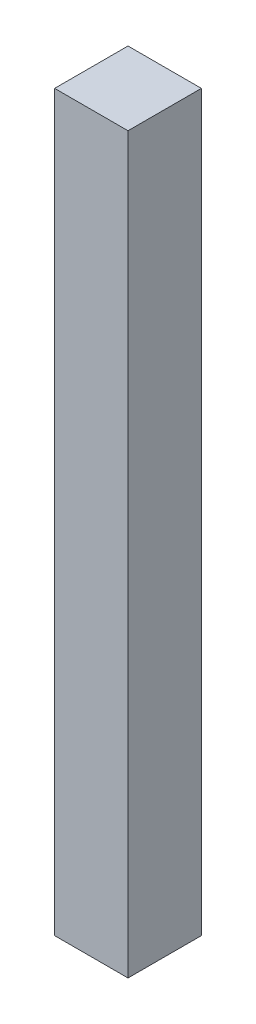
ISO-10303-21;
HEADER;
FILE_DESCRIPTION(('STEP AP214'),'2;1');
FILE_NAME('part.step','',(''),(''),'','','');
FILE_SCHEMA(('AUTOMOTIVE_DESIGN { 1 0 10303 214 1 1 1 1 }'));
ENDSEC;
DATA;
#1=APPLICATION_CONTEXT('core data for automotive mechanical design processes');
#2=APPLICATION_PROTOCOL_DEFINITION('international standard','automotive_design',2000,#1);
#3=PRODUCT_CONTEXT('',#1,'mechanical');
#4=PRODUCT('Part','Part','',(#3));
#5=PRODUCT_RELATED_PRODUCT_CATEGORY('part','',(#4));
#6=PRODUCT_DEFINITION_FORMATION('','',#4);
#7=PRODUCT_DEFINITION_CONTEXT('part definition',#1,'design');
#8=PRODUCT_DEFINITION('design','',#6,#7);
#9=PRODUCT_DEFINITION_SHAPE('','',#8);
#10=(LENGTH_UNIT() NAMED_UNIT(*) SI_UNIT(.MILLI.,.METRE.));
#11=(NAMED_UNIT(*) PLANE_ANGLE_UNIT() SI_UNIT($,.RADIAN.));
#12=(NAMED_UNIT(*) SI_UNIT($,.STERADIAN.) SOLID_ANGLE_UNIT());
#13=UNCERTAINTY_MEASURE_WITH_UNIT(LENGTH_MEASURE(1.E-05),#10,'distance_accuracy_value','');
#14=(GEOMETRIC_REPRESENTATION_CONTEXT(3) GLOBAL_UNCERTAINTY_ASSIGNED_CONTEXT((#13)) GLOBAL_UNIT_ASSIGNED_CONTEXT((#10,
#11,#12)) REPRESENTATION_CONTEXT('',''));
#15=CARTESIAN_POINT('',(0.,0.,0.));
#16=DIRECTION('',(0.,0.,1.));
#17=DIRECTION('',(1.,0.,0.));
#18=AXIS2_PLACEMENT_3D('',#15,#16,#17);
#19=CARTESIAN_POINT('',(5.,-50.,10.));
#20=DIRECTION('',(-1.,0.,0.));
#21=DIRECTION('',(0.,0.,1.));
#22=AXIS2_PLACEMENT_3D('',#19,#20,#21);
#23=PLANE('',#22);
#24=DIRECTION('',(0.,1.,0.));
#25=VECTOR('',#24,1.);
#26=CARTESIAN_POINT('',(5.,-50.,0.));
#27=LINE('',#26,#25);
#28=CARTESIAN_POINT('',(5.,-50.,0.));
#29=VERTEX_POINT('',#28);
#30=CARTESIAN_POINT('',(5.,50.,0.));
#31=VERTEX_POINT('',#30);
#32=EDGE_CURVE('E107',#29,#31,#27,.T.);
#33=ORIENTED_EDGE('',*,*,#32,.T.);
#34=DIRECTION('',(0.,0.,-1.));
#35=VECTOR('',#34,1.);
#36=CARTESIAN_POINT('',(5.,50.,10.));
#37=LINE('',#36,#35);
#38=CARTESIAN_POINT('',(5.,50.,10.));
#39=VERTEX_POINT('',#38);
#40=EDGE_CURVE('E11',#39,#31,#37,.T.);
#41=ORIENTED_EDGE('',*,*,#40,.F.);
#42=DIRECTION('',(0.,1.,0.));
#43=VECTOR('',#42,1.);
#44=CARTESIAN_POINT('',(5.,-50.,10.));
#45=LINE('',#44,#43);
#46=CARTESIAN_POINT('',(5.,-50.,10.));
#47=VERTEX_POINT('',#46);
#48=EDGE_CURVE('E91',#47,#39,#45,.T.);
#49=ORIENTED_EDGE('',*,*,#48,.F.);
#50=DIRECTION('',(0.,0.,-1.));
#51=VECTOR('',#50,1.);
#52=CARTESIAN_POINT('',(5.,-50.,10.));
#53=LINE('',#52,#51);
#54=EDGE_CURVE('E103',#47,#29,#53,.T.);
#55=ORIENTED_EDGE('',*,*,#54,.T.);
#56=EDGE_LOOP('',(#33,#41,#49,#55));
#57=FACE_BOUND('',#56,.T.);
#58=ADVANCED_FACE('F39',(#57),#23,.F.);
#59=CARTESIAN_POINT('',(-5.,50.,10.));
#60=DIRECTION('',(0.,-1.,0.));
#61=DIRECTION('',(0.,0.,-1.));
#62=AXIS2_PLACEMENT_3D('',#59,#60,#61);
#63=PLANE('',#62);
#64=DIRECTION('',(-1.,0.,0.));
#65=VECTOR('',#64,1.);
#66=CARTESIAN_POINT('',(-5.,50.,0.));
#67=LINE('',#66,#65);
#68=CARTESIAN_POINT('',(-5.,50.,0.));
#69=VERTEX_POINT('',#68);
#70=EDGE_CURVE('E96',#31,#69,#67,.T.);
#71=ORIENTED_EDGE('',*,*,#70,.T.);
#72=DIRECTION('',(0.,0.,-1.));
#73=VECTOR('',#72,1.);
#74=CARTESIAN_POINT('',(-5.,50.,10.));
#75=LINE('',#74,#73);
#76=CARTESIAN_POINT('',(-5.,50.,10.));
#77=VERTEX_POINT('',#76);
#78=EDGE_CURVE('E48',#77,#69,#75,.T.);
#79=ORIENTED_EDGE('',*,*,#78,.F.);
#80=DIRECTION('',(-1.,0.,0.));
#81=VECTOR('',#80,1.);
#82=CARTESIAN_POINT('',(-5.,50.,10.));
#83=LINE('',#82,#81);
#84=EDGE_CURVE('E86',#39,#77,#83,.T.);
#85=ORIENTED_EDGE('',*,*,#84,.F.);
#86=ORIENTED_EDGE('',*,*,#40,.T.);
#87=EDGE_LOOP('',(#71,#79,#85,#86));
#88=FACE_BOUND('',#87,.T.);
#89=ADVANCED_FACE('F95',(#88),#63,.F.);
#90=CARTESIAN_POINT('',(-5.,-50.,10.));
#91=DIRECTION('',(1.,0.,0.));
#92=DIRECTION('',(0.,0.,-1.));
#93=AXIS2_PLACEMENT_3D('',#90,#91,#92);
#94=PLANE('',#93);
#95=DIRECTION('',(0.,-1.,0.));
#96=VECTOR('',#95,1.);
#97=CARTESIAN_POINT('',(-5.,-50.,0.));
#98=LINE('',#97,#96);
#99=CARTESIAN_POINT('',(-5.,-50.,0.));
#100=VERTEX_POINT('',#99);
#101=EDGE_CURVE('E73',#69,#100,#98,.T.);
#102=ORIENTED_EDGE('',*,*,#101,.T.);
#103=DIRECTION('',(0.,0.,-1.));
#104=VECTOR('',#103,1.);
#105=CARTESIAN_POINT('',(-5.,-50.,10.));
#106=LINE('',#105,#104);
#107=CARTESIAN_POINT('',(-5.,-50.,10.));
#108=VERTEX_POINT('',#107);
#109=EDGE_CURVE('E98',#108,#100,#106,.T.);
#110=ORIENTED_EDGE('',*,*,#109,.F.);
#111=DIRECTION('',(0.,-1.,0.));
#112=VECTOR('',#111,1.);
#113=CARTESIAN_POINT('',(-5.,-50.,10.));
#114=LINE('',#113,#112);
#115=EDGE_CURVE('E89',#77,#108,#114,.T.);
#116=ORIENTED_EDGE('',*,*,#115,.F.);
#117=ORIENTED_EDGE('',*,*,#78,.T.);
#118=EDGE_LOOP('',(#102,#110,#116,#117));
#119=FACE_BOUND('',#118,.T.);
#120=ADVANCED_FACE('F99',(#119),#94,.F.);
#121=CARTESIAN_POINT('',(-5.,-50.,10.));
#122=DIRECTION('',(0.,1.,0.));
#123=DIRECTION('',(0.,0.,1.));
#124=AXIS2_PLACEMENT_3D('',#121,#122,#123);
#125=PLANE('',#124);
#126=DIRECTION('',(1.,0.,0.));
#127=VECTOR('',#126,1.);
#128=CARTESIAN_POINT('',(-5.,-50.,0.));
#129=LINE('',#128,#127);
#130=EDGE_CURVE('E79',#100,#29,#129,.T.);
#131=ORIENTED_EDGE('',*,*,#130,.T.);
#132=ORIENTED_EDGE('',*,*,#54,.F.);
#133=DIRECTION('',(1.,0.,0.));
#134=VECTOR('',#133,1.);
#135=CARTESIAN_POINT('',(-5.,-50.,10.));
#136=LINE('',#135,#134);
#137=EDGE_CURVE('E56',#108,#47,#136,.T.);
#138=ORIENTED_EDGE('',*,*,#137,.F.);
#139=ORIENTED_EDGE('',*,*,#109,.T.);
#140=EDGE_LOOP('',(#131,#132,#138,#139));
#141=FACE_BOUND('',#140,.T.);
#142=ADVANCED_FACE('F120',(#141),#125,.F.);
#143=CARTESIAN_POINT('',(0.,0.,10.));
#144=DIRECTION('',(0.,0.,-1.));
#145=DIRECTION('',(-1.,0.,0.));
#146=AXIS2_PLACEMENT_3D('',#143,#144,#145);
#147=PLANE('',#146);
#148=ORIENTED_EDGE('',*,*,#48,.T.);
#149=ORIENTED_EDGE('',*,*,#84,.T.);
#150=ORIENTED_EDGE('',*,*,#115,.T.);
#151=ORIENTED_EDGE('',*,*,#137,.T.);
#152=EDGE_LOOP('',(#148,#149,#150,#151));
#153=FACE_BOUND('',#152,.T.);
#154=ADVANCED_FACE('F87',(#153),#147,.F.);
#155=CARTESIAN_POINT('',(0.,0.,0.));
#156=DIRECTION('',(0.,0.,-1.));
#157=DIRECTION('',(-1.,0.,0.));
#158=AXIS2_PLACEMENT_3D('',#155,#156,#157);
#159=PLANE('',#158);
#160=ORIENTED_EDGE('',*,*,#32,.F.);
#161=ORIENTED_EDGE('',*,*,#130,.F.);
#162=ORIENTED_EDGE('',*,*,#101,.F.);
#163=ORIENTED_EDGE('',*,*,#70,.F.);
#164=EDGE_LOOP('',(#160,#161,#162,#163));
#165=FACE_BOUND('',#164,.T.);
#166=ADVANCED_FACE('F123',(#165),#159,.T.);
#167=CLOSED_SHELL('',(#58,#89,#120,#142,#154,#166));
#168=MANIFOLD_SOLID_BREP('B2',#167);
#169=ADVANCED_BREP_SHAPE_REPRESENTATION('',(#18,#168),#14);
#170=SHAPE_DEFINITION_REPRESENTATION(#9,#169);
ENDSEC;
END-ISO-10303-21;
